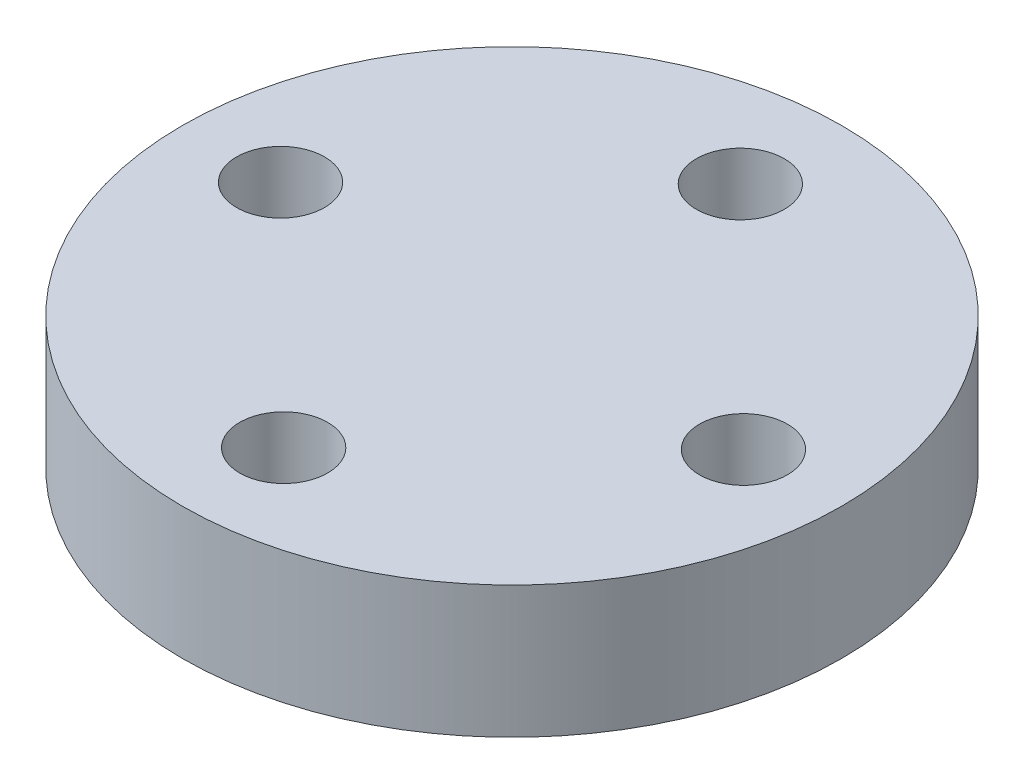
ISO-10303-21;
HEADER;
FILE_DESCRIPTION(('STEP AP214'),'2;1');
FILE_NAME('part.step','',(''),(''),'','','');
FILE_SCHEMA(('AUTOMOTIVE_DESIGN { 1 0 10303 214 1 1 1 1 }'));
ENDSEC;
DATA;
#1=APPLICATION_CONTEXT('core data for automotive mechanical design processes');
#2=APPLICATION_PROTOCOL_DEFINITION('international standard','automotive_design',2000,#1);
#3=PRODUCT_CONTEXT('',#1,'mechanical');
#4=PRODUCT('Part','Part','',(#3));
#5=PRODUCT_RELATED_PRODUCT_CATEGORY('part','',(#4));
#6=PRODUCT_DEFINITION_FORMATION('','',#4);
#7=PRODUCT_DEFINITION_CONTEXT('part definition',#1,'design');
#8=PRODUCT_DEFINITION('design','',#6,#7);
#9=PRODUCT_DEFINITION_SHAPE('','',#8);
#10=(LENGTH_UNIT() NAMED_UNIT(*) SI_UNIT(.MILLI.,.METRE.));
#11=(NAMED_UNIT(*) PLANE_ANGLE_UNIT() SI_UNIT($,.RADIAN.));
#12=(NAMED_UNIT(*) SI_UNIT($,.STERADIAN.) SOLID_ANGLE_UNIT());
#13=UNCERTAINTY_MEASURE_WITH_UNIT(LENGTH_MEASURE(1.E-05),#10,'distance_accuracy_value','');
#14=(GEOMETRIC_REPRESENTATION_CONTEXT(3) GLOBAL_UNCERTAINTY_ASSIGNED_CONTEXT((#13)) GLOBAL_UNIT_ASSIGNED_CONTEXT((#10,
#11,#12)) REPRESENTATION_CONTEXT('',''));
#15=CARTESIAN_POINT('',(0.,0.,0.));
#16=DIRECTION('',(0.,0.,1.));
#17=DIRECTION('',(1.,0.,0.));
#18=AXIS2_PLACEMENT_3D('',#15,#16,#17);
#19=CARTESIAN_POINT('',(0.,-30.,0.));
#20=DIRECTION('',(0.,1.,0.));
#21=DIRECTION('',(0.,0.,1.));
#22=AXIS2_PLACEMENT_3D('',#19,#20,#21);
#23=CYLINDRICAL_SURFACE('',#22,75.);
#24=CARTESIAN_POINT('',(0.,-30.,0.));
#25=DIRECTION('',(0.,1.,0.));
#26=DIRECTION('',(0.,0.,1.));
#27=AXIS2_PLACEMENT_3D('',#24,#25,#26);
#28=CIRCLE('',#27,75.);
#29=CARTESIAN_POINT('',(0.,-30.,75.));
#30=VERTEX_POINT('',#29);
#31=EDGE_CURVE('E46',#30,#30,#28,.T.);
#32=ORIENTED_EDGE('',*,*,#31,.T.);
#33=EDGE_LOOP('',(#32));
#34=FACE_BOUND('',#33,.T.);
#35=CARTESIAN_POINT('',(0.,0.,0.));
#36=DIRECTION('',(0.,1.,0.));
#37=DIRECTION('',(0.,0.,1.));
#38=AXIS2_PLACEMENT_3D('',#35,#36,#37);
#39=CIRCLE('',#38,75.);
#40=CARTESIAN_POINT('',(0.,0.,75.));
#41=VERTEX_POINT('',#40);
#42=EDGE_CURVE('E170',#41,#41,#39,.T.);
#43=ORIENTED_EDGE('',*,*,#42,.F.);
#44=EDGE_LOOP('',(#43));
#45=FACE_BOUND('',#44,.T.);
#46=ADVANCED_FACE('F39',(#34,#45),#23,.T.);
#47=CARTESIAN_POINT('',(0.,-30.,0.));
#48=DIRECTION('',(0.,1.,0.));
#49=DIRECTION('',(0.,0.,1.));
#50=AXIS2_PLACEMENT_3D('',#47,#48,#49);
#51=PLANE('',#50);
#52=CARTESIAN_POINT('',(0.,-30.,0.));
#53=DIRECTION('',(0.,1.,0.));
#54=DIRECTION('',(0.,0.,1.));
#55=AXIS2_PLACEMENT_3D('',#52,#53,#54);
#56=CIRCLE('',#55,20.);
#57=CARTESIAN_POINT('',(0.,-30.,20.));
#58=VERTEX_POINT('',#57);
#59=EDGE_CURVE('E11',#58,#58,#56,.F.);
#60=ORIENTED_EDGE('',*,*,#59,.F.);
#61=EDGE_LOOP('',(#60));
#62=FACE_BOUND('',#61,.T.);
#63=CARTESIAN_POINT('',(0.,-30.,-51.9402987549459));
#64=DIRECTION('',(0.,1.,0.));
#65=DIRECTION('',(0.,0.,-1.));
#66=AXIS2_PLACEMENT_3D('',#63,#64,#65);
#67=CIRCLE('',#66,10.);
#68=CARTESIAN_POINT('',(0.,-30.,-61.9402987549459));
#69=VERTEX_POINT('',#68);
#70=EDGE_CURVE('E149',#69,#69,#67,.T.);
#71=ORIENTED_EDGE('',*,*,#70,.T.);
#72=EDGE_LOOP('',(#71));
#73=FACE_BOUND('',#72,.T.);
#74=CARTESIAN_POINT('',(-52.6485755561497,-30.,0.));
#75=DIRECTION('',(0.,1.,0.));
#76=DIRECTION('',(0.,0.,-1.));
#77=AXIS2_PLACEMENT_3D('',#74,#75,#76);
#78=CIRCLE('',#77,10.);
#79=CARTESIAN_POINT('',(-52.6485755561497,-30.,-10.));
#80=VERTEX_POINT('',#79);
#81=EDGE_CURVE('E155',#80,#80,#78,.T.);
#82=ORIENTED_EDGE('',*,*,#81,.T.);
#83=EDGE_LOOP('',(#82));
#84=FACE_BOUND('',#83,.T.);
#85=CARTESIAN_POINT('',(52.6485755561497,-30.,0.));
#86=DIRECTION('',(0.,1.,0.));
#87=DIRECTION('',(0.,0.,1.));
#88=AXIS2_PLACEMENT_3D('',#85,#86,#87);
#89=CIRCLE('',#88,10.);
#90=CARTESIAN_POINT('',(52.6485755561497,-30.,10.));
#91=VERTEX_POINT('',#90);
#92=EDGE_CURVE('E161',#91,#91,#89,.T.);
#93=ORIENTED_EDGE('',*,*,#92,.T.);
#94=EDGE_LOOP('',(#93));
#95=FACE_BOUND('',#94,.T.);
#96=CARTESIAN_POINT('',(0.,-30.,51.9402987549459));
#97=DIRECTION('',(0.,1.,0.));
#98=DIRECTION('',(0.,0.,1.));
#99=AXIS2_PLACEMENT_3D('',#96,#97,#98);
#100=CIRCLE('',#99,10.);
#101=CARTESIAN_POINT('',(0.,-30.,61.9402987549459));
#102=VERTEX_POINT('',#101);
#103=EDGE_CURVE('E167',#102,#102,#100,.T.);
#104=ORIENTED_EDGE('',*,*,#103,.T.);
#105=EDGE_LOOP('',(#104));
#106=FACE_BOUND('',#105,.T.);
#107=ORIENTED_EDGE('',*,*,#31,.F.);
#108=EDGE_LOOP('',(#107));
#109=FACE_BOUND('',#108,.T.);
#110=ADVANCED_FACE('F180',(#62,#73,#84,#95,#106,#109),#51,.F.);
#111=CARTESIAN_POINT('',(0.,0.,0.));
#112=DIRECTION('',(0.,1.,0.));
#113=DIRECTION('',(0.,0.,1.));
#114=AXIS2_PLACEMENT_3D('',#111,#112,#113);
#115=PLANE('',#114);
#116=CARTESIAN_POINT('',(0.,0.,-51.9402987549459));
#117=DIRECTION('',(0.,1.,0.));
#118=DIRECTION('',(0.,0.,-1.));
#119=AXIS2_PLACEMENT_3D('',#116,#117,#118);
#120=CIRCLE('',#119,10.);
#121=CARTESIAN_POINT('',(0.,0.,-61.9402987549459));
#122=VERTEX_POINT('',#121);
#123=EDGE_CURVE('E148',#122,#122,#120,.T.);
#124=ORIENTED_EDGE('',*,*,#123,.F.);
#125=EDGE_LOOP('',(#124));
#126=FACE_BOUND('',#125,.T.);
#127=CARTESIAN_POINT('',(-52.6485755561497,0.,0.));
#128=DIRECTION('',(0.,1.,0.));
#129=DIRECTION('',(0.,0.,-1.));
#130=AXIS2_PLACEMENT_3D('',#127,#128,#129);
#131=CIRCLE('',#130,10.);
#132=CARTESIAN_POINT('',(-52.6485755561497,0.,-10.));
#133=VERTEX_POINT('',#132);
#134=EDGE_CURVE('E152',#133,#133,#131,.T.);
#135=ORIENTED_EDGE('',*,*,#134,.F.);
#136=EDGE_LOOP('',(#135));
#137=FACE_BOUND('',#136,.T.);
#138=CARTESIAN_POINT('',(52.6485755561497,0.,0.));
#139=DIRECTION('',(0.,1.,0.));
#140=DIRECTION('',(0.,0.,1.));
#141=AXIS2_PLACEMENT_3D('',#138,#139,#140);
#142=CIRCLE('',#141,10.);
#143=CARTESIAN_POINT('',(52.6485755561497,0.,10.));
#144=VERTEX_POINT('',#143);
#145=EDGE_CURVE('E158',#144,#144,#142,.T.);
#146=ORIENTED_EDGE('',*,*,#145,.F.);
#147=EDGE_LOOP('',(#146));
#148=FACE_BOUND('',#147,.T.);
#149=CARTESIAN_POINT('',(0.,0.,51.9402987549459));
#150=DIRECTION('',(0.,1.,0.));
#151=DIRECTION('',(0.,0.,1.));
#152=AXIS2_PLACEMENT_3D('',#149,#150,#151);
#153=CIRCLE('',#152,10.);
#154=CARTESIAN_POINT('',(0.,0.,61.9402987549459));
#155=VERTEX_POINT('',#154);
#156=EDGE_CURVE('E164',#155,#155,#153,.T.);
#157=ORIENTED_EDGE('',*,*,#156,.F.);
#158=EDGE_LOOP('',(#157));
#159=FACE_BOUND('',#158,.T.);
#160=ORIENTED_EDGE('',*,*,#42,.T.);
#161=EDGE_LOOP('',(#160));
#162=FACE_BOUND('',#161,.T.);
#163=ADVANCED_FACE('F177',(#126,#137,#148,#159,#162),#115,.T.);
#164=CARTESIAN_POINT('',(0.,-30.,51.9402987549459));
#165=DIRECTION('',(0.,1.,0.));
#166=DIRECTION('',(0.,0.,1.));
#167=AXIS2_PLACEMENT_3D('',#164,#165,#166);
#168=CYLINDRICAL_SURFACE('',#167,10.);
#169=ORIENTED_EDGE('',*,*,#103,.F.);
#170=EDGE_LOOP('',(#169));
#171=FACE_BOUND('',#170,.T.);
#172=ORIENTED_EDGE('',*,*,#156,.T.);
#173=EDGE_LOOP('',(#172));
#174=FACE_BOUND('',#173,.T.);
#175=ADVANCED_FACE('F195',(#171,#174),#168,.F.);
#176=CARTESIAN_POINT('',(52.6485755561497,-30.,0.));
#177=DIRECTION('',(0.,1.,0.));
#178=DIRECTION('',(0.,0.,1.));
#179=AXIS2_PLACEMENT_3D('',#176,#177,#178);
#180=CYLINDRICAL_SURFACE('',#179,10.);
#181=ORIENTED_EDGE('',*,*,#92,.F.);
#182=EDGE_LOOP('',(#181));
#183=FACE_BOUND('',#182,.T.);
#184=ORIENTED_EDGE('',*,*,#145,.T.);
#185=EDGE_LOOP('',(#184));
#186=FACE_BOUND('',#185,.T.);
#187=ADVANCED_FACE('F201',(#183,#186),#180,.F.);
#188=CARTESIAN_POINT('',(-52.6485755561497,-30.,0.));
#189=DIRECTION('',(0.,1.,0.));
#190=DIRECTION('',(0.,0.,1.));
#191=AXIS2_PLACEMENT_3D('',#188,#189,#190);
#192=CYLINDRICAL_SURFACE('',#191,10.);
#193=ORIENTED_EDGE('',*,*,#81,.F.);
#194=EDGE_LOOP('',(#193));
#195=FACE_BOUND('',#194,.T.);
#196=ORIENTED_EDGE('',*,*,#134,.T.);
#197=EDGE_LOOP('',(#196));
#198=FACE_BOUND('',#197,.T.);
#199=ADVANCED_FACE('F205',(#195,#198),#192,.F.);
#200=CARTESIAN_POINT('',(0.,-30.,-51.9402987549459));
#201=DIRECTION('',(0.,1.,0.));
#202=DIRECTION('',(0.,0.,1.));
#203=AXIS2_PLACEMENT_3D('',#200,#201,#202);
#204=CYLINDRICAL_SURFACE('',#203,10.);
#205=ORIENTED_EDGE('',*,*,#70,.F.);
#206=EDGE_LOOP('',(#205));
#207=FACE_BOUND('',#206,.T.);
#208=ORIENTED_EDGE('',*,*,#123,.T.);
#209=EDGE_LOOP('',(#208));
#210=FACE_BOUND('',#209,.T.);
#211=ADVANCED_FACE('F209',(#207,#210),#204,.F.);
#212=CARTESIAN_POINT('',(0.,-60.,0.));
#213=DIRECTION('',(0.,1.,0.));
#214=DIRECTION('',(0.,0.,1.));
#215=AXIS2_PLACEMENT_3D('',#212,#213,#214);
#216=CYLINDRICAL_SURFACE('',#215,20.);
#217=CARTESIAN_POINT('',(0.,-60.,0.));
#218=DIRECTION('',(0.,-1.,0.));
#219=DIRECTION('',(0.,0.,-1.));
#220=AXIS2_PLACEMENT_3D('',#217,#218,#219);
#221=CIRCLE('',#220,20.);
#222=CARTESIAN_POINT('',(0.,-60.,-20.));
#223=VERTEX_POINT('',#222);
#224=EDGE_CURVE('E140',#223,#223,#221,.T.);
#225=ORIENTED_EDGE('',*,*,#224,.F.);
#226=EDGE_LOOP('',(#225));
#227=FACE_BOUND('',#226,.T.);
#228=ORIENTED_EDGE('',*,*,#59,.T.);
#229=EDGE_LOOP('',(#228));
#230=FACE_BOUND('',#229,.T.);
#231=ADVANCED_FACE('F212',(#227,#230),#216,.T.);
#232=CARTESIAN_POINT('',(0.,-60.,0.));
#233=DIRECTION('',(0.,-1.,0.));
#234=DIRECTION('',(0.,0.,-1.));
#235=AXIS2_PLACEMENT_3D('',#232,#233,#234);
#236=PLANE('',#235);
#237=DIRECTION('',(-0.537675920212552,0.,0.84315159065472));
#238=VECTOR('',#237,1.);
#239=CARTESIAN_POINT('',(4.61431571170484,-60.,0.203528489521552));
#240=LINE('',#239,#238);
#241=CARTESIAN_POINT('',(4.61431571170484,-60.,0.203528489521552));
#242=VERTEX_POINT('',#241);
#243=CARTESIAN_POINT('',(2.13089701353288,-60.,4.09787887217884));
#244=VERTEX_POINT('',#243);
#245=EDGE_CURVE('E53',#242,#244,#240,.T.);
#246=ORIENTED_EDGE('',*,*,#245,.F.);
#247=DIRECTION('',(0.46135273664197,0.,0.887216801234605));
#248=VECTOR('',#247,1.);
#249=CARTESIAN_POINT('',(2.48341869817196,-60.,-3.89435038265729));
#250=LINE('',#249,#248);
#251=CARTESIAN_POINT('',(2.48341869817196,-60.,-3.89435038265729));
#252=VERTEX_POINT('',#251);
#253=EDGE_CURVE('E136',#252,#242,#250,.T.);
#254=ORIENTED_EDGE('',*,*,#253,.F.);
#255=DIRECTION('',(0.999028656854522,0.,0.0440652105798851));
#256=VECTOR('',#255,1.);
#257=CARTESIAN_POINT('',(-2.13089701353288,-60.,-4.09787887217885));
#258=LINE('',#257,#256);
#259=CARTESIAN_POINT('',(-2.13089701353288,-60.,-4.09787887217885));
#260=VERTEX_POINT('',#259);
#261=EDGE_CURVE('E134',#260,#252,#258,.T.);
#262=ORIENTED_EDGE('',*,*,#261,.F.);
#263=DIRECTION('',(0.537675920212552,0.,-0.84315159065472));
#264=VECTOR('',#263,1.);
#265=CARTESIAN_POINT('',(-4.61431571170485,-60.,-0.203528489521551));
#266=LINE('',#265,#264);
#267=CARTESIAN_POINT('',(-4.61431571170485,-60.,-0.203528489521551));
#268=VERTEX_POINT('',#267);
#269=EDGE_CURVE('E101',#268,#260,#266,.T.);
#270=ORIENTED_EDGE('',*,*,#269,.F.);
#271=DIRECTION('',(-0.46135273664197,0.,-0.887216801234605));
#272=VECTOR('',#271,1.);
#273=CARTESIAN_POINT('',(-2.48341869817196,-60.,3.89435038265729));
#274=LINE('',#273,#272);
#275=CARTESIAN_POINT('',(-2.48341869817196,-60.,3.89435038265729));
#276=VERTEX_POINT('',#275);
#277=EDGE_CURVE('E130',#276,#268,#274,.T.);
#278=ORIENTED_EDGE('',*,*,#277,.F.);
#279=DIRECTION('',(-0.999028656854522,0.,-0.044065210579885));
#280=VECTOR('',#279,1.);
#281=CARTESIAN_POINT('',(2.13089701353288,-60.,4.09787887217884));
#282=LINE('',#281,#280);
#283=EDGE_CURVE('E127',#244,#276,#282,.T.);
#284=ORIENTED_EDGE('',*,*,#283,.F.);
#285=EDGE_LOOP('',(#246,#254,#262,#270,#278,#284));
#286=FACE_BOUND('',#285,.T.);
#287=ORIENTED_EDGE('',*,*,#224,.T.);
#288=EDGE_LOOP('',(#287));
#289=FACE_BOUND('',#288,.T.);
#290=ADVANCED_FACE('F215',(#286,#289),#236,.T.);
#291=CARTESIAN_POINT('',(4.61431571170484,-37.,0.203528489521552));
#292=DIRECTION('',(0.843151590654721,0.,0.537675920212552));
#293=DIRECTION('',(0.537675920212552,0.,-0.843151590654721));
#294=AXIS2_PLACEMENT_3D('',#291,#292,#293);
#295=PLANE('',#294);
#296=ORIENTED_EDGE('',*,*,#245,.T.);
#297=DIRECTION('',(0.,-1.,0.));
#298=VECTOR('',#297,1.);
#299=CARTESIAN_POINT('',(2.13089701353288,-37.,4.09787887217884));
#300=LINE('',#299,#298);
#301=CARTESIAN_POINT('',(2.13089701353288,-37.,4.09787887217884));
#302=VERTEX_POINT('',#301);
#303=EDGE_CURVE('E83',#302,#244,#300,.T.);
#304=ORIENTED_EDGE('',*,*,#303,.F.);
#305=DIRECTION('',(-0.537675920212552,0.,0.84315159065472));
#306=VECTOR('',#305,1.);
#307=CARTESIAN_POINT('',(4.61431571170484,-37.,0.203528489521552));
#308=LINE('',#307,#306);
#309=CARTESIAN_POINT('',(4.61431571170484,-37.,0.203528489521552));
#310=VERTEX_POINT('',#309);
#311=EDGE_CURVE('E138',#310,#302,#308,.T.);
#312=ORIENTED_EDGE('',*,*,#311,.F.);
#313=DIRECTION('',(0.,-1.,0.));
#314=VECTOR('',#313,1.);
#315=CARTESIAN_POINT('',(4.61431571170484,-37.,0.203528489521552));
#316=LINE('',#315,#314);
#317=EDGE_CURVE('E61',#310,#242,#316,.T.);
#318=ORIENTED_EDGE('',*,*,#317,.T.);
#319=EDGE_LOOP('',(#296,#304,#312,#318));
#320=FACE_BOUND('',#319,.T.);
#321=ADVANCED_FACE('F219',(#320),#295,.F.);
#322=CARTESIAN_POINT('',(2.48341869817196,-37.,-3.89435038265729));
#323=DIRECTION('',(0.887216801234605,0.,-0.46135273664197));
#324=DIRECTION('',(-0.46135273664197,0.,-0.887216801234605));
#325=AXIS2_PLACEMENT_3D('',#322,#323,#324);
#326=PLANE('',#325);
#327=ORIENTED_EDGE('',*,*,#253,.T.);
#328=ORIENTED_EDGE('',*,*,#317,.F.);
#329=DIRECTION('',(0.46135273664197,0.,0.887216801234605));
#330=VECTOR('',#329,1.);
#331=CARTESIAN_POINT('',(2.48341869817196,-37.,-3.89435038265729));
#332=LINE('',#331,#330);
#333=CARTESIAN_POINT('',(2.48341869817196,-37.,-3.89435038265729));
#334=VERTEX_POINT('',#333);
#335=EDGE_CURVE('E113',#334,#310,#332,.T.);
#336=ORIENTED_EDGE('',*,*,#335,.F.);
#337=DIRECTION('',(0.,-1.,0.));
#338=VECTOR('',#337,1.);
#339=CARTESIAN_POINT('',(2.48341869817196,-37.,-3.89435038265729));
#340=LINE('',#339,#338);
#341=EDGE_CURVE('E105',#334,#252,#340,.T.);
#342=ORIENTED_EDGE('',*,*,#341,.T.);
#343=EDGE_LOOP('',(#327,#328,#336,#342));
#344=FACE_BOUND('',#343,.T.);
#345=ADVANCED_FACE('F223',(#344),#326,.F.);
#346=CARTESIAN_POINT('',(-2.13089701353288,-37.,-4.09787887217885));
#347=DIRECTION('',(0.0440652105798851,0.,-0.999028656854522));
#348=DIRECTION('',(-0.999028656854522,0.,-0.0440652105798851));
#349=AXIS2_PLACEMENT_3D('',#346,#347,#348);
#350=PLANE('',#349);
#351=ORIENTED_EDGE('',*,*,#261,.T.);
#352=ORIENTED_EDGE('',*,*,#341,.F.);
#353=DIRECTION('',(0.999028656854522,0.,0.0440652105798851));
#354=VECTOR('',#353,1.);
#355=CARTESIAN_POINT('',(-2.13089701353288,-37.,-4.09787887217885));
#356=LINE('',#355,#354);
#357=CARTESIAN_POINT('',(-2.13089701353288,-37.,-4.09787887217885));
#358=VERTEX_POINT('',#357);
#359=EDGE_CURVE('E109',#358,#334,#356,.T.);
#360=ORIENTED_EDGE('',*,*,#359,.F.);
#361=DIRECTION('',(0.,-1.,0.));
#362=VECTOR('',#361,1.);
#363=CARTESIAN_POINT('',(-2.13089701353288,-37.,-4.09787887217885));
#364=LINE('',#363,#362);
#365=EDGE_CURVE('E94',#358,#260,#364,.T.);
#366=ORIENTED_EDGE('',*,*,#365,.T.);
#367=EDGE_LOOP('',(#351,#352,#360,#366));
#368=FACE_BOUND('',#367,.T.);
#369=ADVANCED_FACE('F110',(#368),#350,.F.);
#370=CARTESIAN_POINT('',(-4.61431571170485,-37.,-0.203528489521551));
#371=DIRECTION('',(-0.84315159065472,0.,-0.537675920212552));
#372=DIRECTION('',(-0.537675920212552,0.,0.843151590654721));
#373=AXIS2_PLACEMENT_3D('',#370,#371,#372);
#374=PLANE('',#373);
#375=ORIENTED_EDGE('',*,*,#269,.T.);
#376=ORIENTED_EDGE('',*,*,#365,.F.);
#377=DIRECTION('',(0.537675920212552,0.,-0.84315159065472));
#378=VECTOR('',#377,1.);
#379=CARTESIAN_POINT('',(-4.61431571170485,-37.,-0.203528489521551));
#380=LINE('',#379,#378);
#381=CARTESIAN_POINT('',(-4.61431571170485,-37.,-0.203528489521551));
#382=VERTEX_POINT('',#381);
#383=EDGE_CURVE('E98',#382,#358,#380,.T.);
#384=ORIENTED_EDGE('',*,*,#383,.F.);
#385=DIRECTION('',(0.,-1.,0.));
#386=VECTOR('',#385,1.);
#387=CARTESIAN_POINT('',(-4.61431571170485,-37.,-0.203528489521551));
#388=LINE('',#387,#386);
#389=EDGE_CURVE('E106',#382,#268,#388,.T.);
#390=ORIENTED_EDGE('',*,*,#389,.T.);
#391=EDGE_LOOP('',(#375,#376,#384,#390));
#392=FACE_BOUND('',#391,.T.);
#393=ADVANCED_FACE('F96',(#392),#374,.F.);
#394=CARTESIAN_POINT('',(-2.48341869817196,-37.,3.89435038265729));
#395=DIRECTION('',(-0.887216801234605,0.,0.46135273664197));
#396=DIRECTION('',(0.46135273664197,0.,0.887216801234605));
#397=AXIS2_PLACEMENT_3D('',#394,#395,#396);
#398=PLANE('',#397);
#399=ORIENTED_EDGE('',*,*,#277,.T.);
#400=ORIENTED_EDGE('',*,*,#389,.F.);
#401=DIRECTION('',(-0.46135273664197,0.,-0.887216801234605));
#402=VECTOR('',#401,1.);
#403=CARTESIAN_POINT('',(-2.48341869817196,-37.,3.89435038265729));
#404=LINE('',#403,#402);
#405=CARTESIAN_POINT('',(-2.48341869817196,-37.,3.89435038265729));
#406=VERTEX_POINT('',#405);
#407=EDGE_CURVE('E119',#406,#382,#404,.T.);
#408=ORIENTED_EDGE('',*,*,#407,.F.);
#409=DIRECTION('',(0.,-1.,0.));
#410=VECTOR('',#409,1.);
#411=CARTESIAN_POINT('',(-2.48341869817196,-37.,3.89435038265729));
#412=LINE('',#411,#410);
#413=EDGE_CURVE('E143',#406,#276,#412,.T.);
#414=ORIENTED_EDGE('',*,*,#413,.T.);
#415=EDGE_LOOP('',(#399,#400,#408,#414));
#416=FACE_BOUND('',#415,.T.);
#417=ADVANCED_FACE('F227',(#416),#398,.F.);
#418=CARTESIAN_POINT('',(2.13089701353288,-37.,4.09787887217884));
#419=DIRECTION('',(-0.044065210579885,0.,0.999028656854522));
#420=DIRECTION('',(0.999028656854522,0.,0.044065210579885));
#421=AXIS2_PLACEMENT_3D('',#418,#419,#420);
#422=PLANE('',#421);
#423=ORIENTED_EDGE('',*,*,#283,.T.);
#424=ORIENTED_EDGE('',*,*,#413,.F.);
#425=DIRECTION('',(-0.999028656854522,0.,-0.044065210579885));
#426=VECTOR('',#425,1.);
#427=CARTESIAN_POINT('',(2.13089701353288,-37.,4.09787887217884));
#428=LINE('',#427,#426);
#429=EDGE_CURVE('E121',#302,#406,#428,.T.);
#430=ORIENTED_EDGE('',*,*,#429,.F.);
#431=ORIENTED_EDGE('',*,*,#303,.T.);
#432=EDGE_LOOP('',(#423,#424,#430,#431));
#433=FACE_BOUND('',#432,.T.);
#434=ADVANCED_FACE('F224',(#433),#422,.F.);
#435=CARTESIAN_POINT('',(0.,-37.,0.));
#436=DIRECTION('',(0.,-1.,0.));
#437=DIRECTION('',(0.,0.,-1.));
#438=AXIS2_PLACEMENT_3D('',#435,#436,#437);
#439=PLANE('',#438);
#440=ORIENTED_EDGE('',*,*,#311,.T.);
#441=ORIENTED_EDGE('',*,*,#429,.T.);
#442=ORIENTED_EDGE('',*,*,#407,.T.);
#443=ORIENTED_EDGE('',*,*,#383,.T.);
#444=ORIENTED_EDGE('',*,*,#359,.T.);
#445=ORIENTED_EDGE('',*,*,#335,.T.);
#446=EDGE_LOOP('',(#440,#441,#442,#443,#444,#445));
#447=FACE_BOUND('',#446,.T.);
#448=ADVANCED_FACE('F116',(#447),#439,.T.);
#449=CLOSED_SHELL('',(#46,#110,#163,#175,#187,#199,#211,#231,#290,#321,#345,#369,#393,#417,#434,#448));
#450=MANIFOLD_SOLID_BREP('B2',#449);
#451=ADVANCED_BREP_SHAPE_REPRESENTATION('',(#18,#450),#14);
#452=SHAPE_DEFINITION_REPRESENTATION(#9,#451);
ENDSEC;
END-ISO-10303-21;
